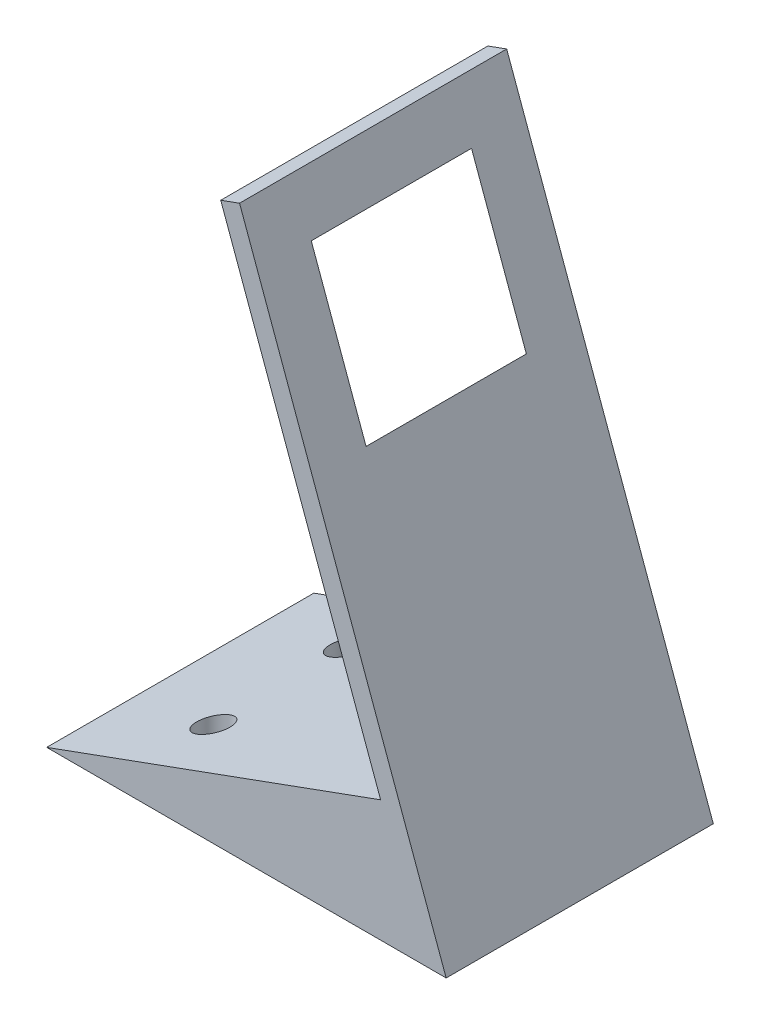
ISO-10303-21;
HEADER;
FILE_DESCRIPTION(('STEP AP214'),'2;1');
FILE_NAME('part.step','',(''),(''),'','','');
FILE_SCHEMA(('AUTOMOTIVE_DESIGN { 1 0 10303 214 1 1 1 1 }'));
ENDSEC;
DATA;
#1=APPLICATION_CONTEXT('core data for automotive mechanical design processes');
#2=APPLICATION_PROTOCOL_DEFINITION('international standard','automotive_design',2000,#1);
#3=PRODUCT_CONTEXT('',#1,'mechanical');
#4=PRODUCT('Part','Part','',(#3));
#5=PRODUCT_RELATED_PRODUCT_CATEGORY('part','',(#4));
#6=PRODUCT_DEFINITION_FORMATION('','',#4);
#7=PRODUCT_DEFINITION_CONTEXT('part definition',#1,'design');
#8=PRODUCT_DEFINITION('design','',#6,#7);
#9=PRODUCT_DEFINITION_SHAPE('','',#8);
#10=(LENGTH_UNIT() NAMED_UNIT(*) SI_UNIT(.MILLI.,.METRE.));
#11=(NAMED_UNIT(*) PLANE_ANGLE_UNIT() SI_UNIT($,.RADIAN.));
#12=(NAMED_UNIT(*) SI_UNIT($,.STERADIAN.) SOLID_ANGLE_UNIT());
#13=UNCERTAINTY_MEASURE_WITH_UNIT(LENGTH_MEASURE(1.E-05),#10,'distance_accuracy_value','');
#14=(GEOMETRIC_REPRESENTATION_CONTEXT(3) GLOBAL_UNCERTAINTY_ASSIGNED_CONTEXT((#13)) GLOBAL_UNIT_ASSIGNED_CONTEXT((#10,
#11,#12)) REPRESENTATION_CONTEXT('',''));
#15=CARTESIAN_POINT('',(0.,0.,0.));
#16=DIRECTION('',(0.,0.,1.));
#17=DIRECTION('',(1.,0.,0.));
#18=AXIS2_PLACEMENT_3D('',#15,#16,#17);
#19=CARTESIAN_POINT('',(52.8190778623577,19.2245721432868,40.));
#20=DIRECTION('',(0.93969262078591,0.342020143325663,0.));
#21=DIRECTION('',(-0.342020143325663,0.939692620785911,0.));
#22=AXIS2_PLACEMENT_3D('',#19,#20,#21);
#23=PLANE('',#22);
#24=DIRECTION('',(0.342020143325663,-0.939692620785911,0.));
#25=VECTOR('',#24,1.);
#26=CARTESIAN_POINT('',(52.8190778623577,19.2245721432868,0.));
#27=LINE('',#26,#25);
#28=CARTESIAN_POINT('',(28.8776678295613,85.0030555983005,0.));
#29=VERTEX_POINT('',#28);
#30=CARTESIAN_POINT('',(59.8162498890172,0.,0.));
#31=VERTEX_POINT('',#30);
#32=EDGE_CURVE('E310',#29,#31,#27,.T.);
#33=ORIENTED_EDGE('',*,*,#32,.F.);
#34=DIRECTION('',(0.,0.,-1.));
#35=VECTOR('',#34,1.);
#36=CARTESIAN_POINT('',(28.8776678295613,85.0030555983005,40.));
#37=LINE('',#36,#35);
#38=CARTESIAN_POINT('',(28.8776678295613,85.0030555983005,40.));
#39=VERTEX_POINT('',#38);
#40=EDGE_CURVE('E53',#39,#29,#37,.T.);
#41=ORIENTED_EDGE('',*,*,#40,.F.);
#42=DIRECTION('',(0.342020143325663,-0.939692620785911,0.));
#43=VECTOR('',#42,1.);
#44=CARTESIAN_POINT('',(52.8190778623577,19.2245721432868,40.));
#45=LINE('',#44,#43);
#46=CARTESIAN_POINT('',(59.8162498890172,0.,40.));
#47=VERTEX_POINT('',#46);
#48=EDGE_CURVE('E294',#39,#47,#45,.T.);
#49=ORIENTED_EDGE('',*,*,#48,.T.);
#50=DIRECTION('',(0.,0.,-1.));
#51=VECTOR('',#50,1.);
#52=CARTESIAN_POINT('',(59.8162498890172,0.,40.));
#53=LINE('',#52,#51);
#54=EDGE_CURVE('E12',#47,#31,#53,.T.);
#55=ORIENTED_EDGE('',*,*,#54,.T.);
#56=EDGE_LOOP('',(#33,#41,#49,#55));
#57=FACE_BOUND('',#56,.T.);
#58=DIRECTION('',(0.,0.,-1.));
#59=VECTOR('',#58,1.);
#60=CARTESIAN_POINT('',(39.8223124159825,54.9328917331513,8.));
#61=LINE('',#60,#59);
#62=CARTESIAN_POINT('',(39.8223124159825,54.9328917331513,32.));
#63=VERTEX_POINT('',#62);
#64=CARTESIAN_POINT('',(39.8223124159825,54.9328917331513,8.00000000000001));
#65=VERTEX_POINT('',#64);
#66=EDGE_CURVE('E47',#63,#65,#61,.T.);
#67=ORIENTED_EDGE('',*,*,#66,.F.);
#68=DIRECTION('',(0.342020143325663,-0.93969262078591,0.));
#69=VECTOR('',#68,1.);
#70=CARTESIAN_POINT('',(31.6138289761666,77.4855146320132,32.));
#71=LINE('',#70,#69);
#72=CARTESIAN_POINT('',(31.6138289761666,77.4855146320132,32.));
#73=VERTEX_POINT('',#72);
#74=EDGE_CURVE('E215',#73,#63,#71,.T.);
#75=ORIENTED_EDGE('',*,*,#74,.F.);
#76=DIRECTION('',(0.,0.,1.));
#77=VECTOR('',#76,1.);
#78=CARTESIAN_POINT('',(31.6138289761666,77.4855146320132,8.));
#79=LINE('',#78,#77);
#80=CARTESIAN_POINT('',(31.6138289761666,77.4855146320132,8.));
#81=VERTEX_POINT('',#80);
#82=EDGE_CURVE('E122',#81,#73,#79,.T.);
#83=ORIENTED_EDGE('',*,*,#82,.F.);
#84=DIRECTION('',(-0.342020143325663,0.93969262078591,0.));
#85=VECTOR('',#84,1.);
#86=CARTESIAN_POINT('',(31.6138289761666,77.4855146320132,8.));
#87=LINE('',#86,#85);
#88=EDGE_CURVE('E186',#65,#81,#87,.T.);
#89=ORIENTED_EDGE('',*,*,#88,.F.);
#90=EDGE_LOOP('',(#67,#75,#83,#89));
#91=FACE_BOUND('',#90,.T.);
#92=ADVANCED_FACE('F43',(#57,#91),#23,.T.);
#93=CARTESIAN_POINT('',(50.,18.1985117133098,40.));
#94=DIRECTION('',(-0.93969262078591,-0.342020143325663,0.));
#95=DIRECTION('',(0.342020143325663,-0.939692620785911,0.));
#96=AXIS2_PLACEMENT_3D('',#93,#94,#95);
#97=PLANE('',#96);
#98=DIRECTION('',(-0.342020143325663,0.939692620785911,0.));
#99=VECTOR('',#98,1.);
#100=CARTESIAN_POINT('',(50.,18.1985117133098,0.));
#101=LINE('',#100,#99);
#102=CARTESIAN_POINT('',(50.,18.1985117133098,0.));
#103=VERTEX_POINT('',#102);
#104=CARTESIAN_POINT('',(26.0585899672036,83.9769951683235,0.));
#105=VERTEX_POINT('',#104);
#106=EDGE_CURVE('E316',#103,#105,#101,.T.);
#107=ORIENTED_EDGE('',*,*,#106,.F.);
#108=DIRECTION('',(0.,0.,-1.));
#109=VECTOR('',#108,1.);
#110=CARTESIAN_POINT('',(50.,18.1985117133098,40.));
#111=LINE('',#110,#109);
#112=CARTESIAN_POINT('',(50.,18.1985117133098,40.));
#113=VERTEX_POINT('',#112);
#114=EDGE_CURVE('E322',#113,#103,#111,.T.);
#115=ORIENTED_EDGE('',*,*,#114,.F.);
#116=DIRECTION('',(-0.342020143325663,0.939692620785911,0.));
#117=VECTOR('',#116,1.);
#118=CARTESIAN_POINT('',(50.,18.1985117133098,40.));
#119=LINE('',#118,#117);
#120=CARTESIAN_POINT('',(26.0585899672036,83.9769951683235,40.));
#121=VERTEX_POINT('',#120);
#122=EDGE_CURVE('E301',#113,#121,#119,.T.);
#123=ORIENTED_EDGE('',*,*,#122,.T.);
#124=DIRECTION('',(0.,0.,-1.));
#125=VECTOR('',#124,1.);
#126=CARTESIAN_POINT('',(26.0585899672036,83.9769951683235,40.));
#127=LINE('',#126,#125);
#128=EDGE_CURVE('E324',#121,#105,#127,.T.);
#129=ORIENTED_EDGE('',*,*,#128,.T.);
#130=EDGE_LOOP('',(#107,#115,#123,#129));
#131=FACE_BOUND('',#130,.T.);
#132=DIRECTION('',(0.,0.,-1.));
#133=VECTOR('',#132,1.);
#134=CARTESIAN_POINT('',(27.7686906838319,79.2785320643939,5.));
#135=LINE('',#134,#133);
#136=CARTESIAN_POINT('',(27.7686906838319,79.2785320643939,35.));
#137=VERTEX_POINT('',#136);
#138=CARTESIAN_POINT('',(27.7686906838319,79.2785320643939,5.00000000000002));
#139=VERTEX_POINT('',#138);
#140=EDGE_CURVE('E118',#137,#139,#135,.T.);
#141=ORIENTED_EDGE('',*,*,#140,.F.);
#142=DIRECTION('',(-0.342020143325663,0.93969262078591,0.));
#143=VECTOR('',#142,1.);
#144=CARTESIAN_POINT('',(27.7686906838319,79.2785320643939,35.));
#145=LINE('',#144,#143);
#146=CARTESIAN_POINT('',(38.0292949836018,51.0877534408166,35.));
#147=VERTEX_POINT('',#146);
#148=EDGE_CURVE('E129',#147,#137,#145,.T.);
#149=ORIENTED_EDGE('',*,*,#148,.F.);
#150=DIRECTION('',(0.,0.,1.));
#151=VECTOR('',#150,1.);
#152=CARTESIAN_POINT('',(38.0292949836018,51.0877534408166,5.));
#153=LINE('',#152,#151);
#154=CARTESIAN_POINT('',(38.0292949836018,51.0877534408166,5.));
#155=VERTEX_POINT('',#154);
#156=EDGE_CURVE('E137',#155,#147,#153,.T.);
#157=ORIENTED_EDGE('',*,*,#156,.F.);
#158=DIRECTION('',(0.342020143325663,-0.93969262078591,0.));
#159=VECTOR('',#158,1.);
#160=CARTESIAN_POINT('',(27.7686906838319,79.2785320643939,5.));
#161=LINE('',#160,#159);
#162=EDGE_CURVE('E143',#139,#155,#161,.T.);
#163=ORIENTED_EDGE('',*,*,#162,.F.);
#164=EDGE_LOOP('',(#141,#149,#157,#163));
#165=FACE_BOUND('',#164,.T.);
#166=ADVANCED_FACE('F142',(#131,#165),#97,.T.);
#167=CARTESIAN_POINT('',(0.,0.,40.));
#168=DIRECTION('',(-0.342020143325663,0.93969262078591,0.));
#169=DIRECTION('',(-0.93969262078591,-0.342020143325663,0.));
#170=AXIS2_PLACEMENT_3D('',#167,#168,#169);
#171=PLANE('',#170);
#172=DIRECTION('',(0.939692620785911,0.342020143325663,0.));
#173=VECTOR('',#172,1.);
#174=CARTESIAN_POINT('',(0.,0.,0.));
#175=LINE('',#174,#173);
#176=CARTESIAN_POINT('',(0.,0.,0.));
#177=VERTEX_POINT('',#176);
#178=EDGE_CURVE('E295',#177,#103,#175,.T.);
#179=ORIENTED_EDGE('',*,*,#178,.F.);
#180=DIRECTION('',(0.,0.,-1.));
#181=VECTOR('',#180,1.);
#182=CARTESIAN_POINT('',(0.,0.,40.));
#183=LINE('',#182,#181);
#184=CARTESIAN_POINT('',(0.,0.,40.));
#185=VERTEX_POINT('',#184);
#186=EDGE_CURVE('E307',#185,#177,#183,.T.);
#187=ORIENTED_EDGE('',*,*,#186,.F.);
#188=DIRECTION('',(0.939692620785911,0.342020143325663,0.));
#189=VECTOR('',#188,1.);
#190=CARTESIAN_POINT('',(0.,0.,40.));
#191=LINE('',#190,#189);
#192=EDGE_CURVE('E304',#185,#113,#191,.T.);
#193=ORIENTED_EDGE('',*,*,#192,.T.);
#194=ORIENTED_EDGE('',*,*,#114,.T.);
#195=EDGE_LOOP('',(#179,#187,#193,#194));
#196=FACE_BOUND('',#195,.T.);
#197=CARTESIAN_POINT('',(44.8621874167629,16.3285008637732,30.));
#198=DIRECTION('',(-0.342020143325663,0.93969262078591,0.));
#199=DIRECTION('',(-0.939692620785911,-0.342020143325663,0.));
#200=AXIS2_PLACEMENT_3D('',#197,#198,#199);
#201=ELLIPSE('',#200,2.66044443118978,2.5);
#202=CARTESIAN_POINT('',(42.3621874167629,15.4185752781077,30.));
#203=VERTEX_POINT('',#202);
#204=EDGE_CURVE('E280',#203,#203,#201,.T.);
#205=ORIENTED_EDGE('',*,*,#204,.F.);
#206=EDGE_LOOP('',(#205));
#207=FACE_BOUND('',#206,.T.);
#208=CARTESIAN_POINT('',(14.9540624722543,5.44283362125772,30.));
#209=DIRECTION('',(-0.342020143325663,0.93969262078591,0.));
#210=DIRECTION('',(-0.939692620785911,-0.342020143325663,0.));
#211=AXIS2_PLACEMENT_3D('',#208,#209,#210);
#212=ELLIPSE('',#211,2.66044443118977,2.5);
#213=CARTESIAN_POINT('',(12.4540624722543,4.53290803559223,30.));
#214=VERTEX_POINT('',#213);
#215=EDGE_CURVE('E271',#214,#214,#212,.F.);
#216=ORIENTED_EDGE('',*,*,#215,.T.);
#217=EDGE_LOOP('',(#216));
#218=FACE_BOUND('',#217,.T.);
#219=CARTESIAN_POINT('',(44.8621874167629,16.3285008637732,10.));
#220=DIRECTION('',(-0.342020143325663,0.93969262078591,0.));
#221=DIRECTION('',(-0.939692620785911,-0.342020143325663,0.));
#222=AXIS2_PLACEMENT_3D('',#219,#220,#221);
#223=ELLIPSE('',#222,2.66044443118978,2.5);
#224=CARTESIAN_POINT('',(42.3621874167629,15.4185752781077,10.));
#225=VERTEX_POINT('',#224);
#226=EDGE_CURVE('E256',#225,#225,#223,.F.);
#227=ORIENTED_EDGE('',*,*,#226,.T.);
#228=EDGE_LOOP('',(#227));
#229=FACE_BOUND('',#228,.T.);
#230=CARTESIAN_POINT('',(14.9540624722543,5.44283362125772,10.));
#231=DIRECTION('',(-0.342020143325663,0.93969262078591,0.));
#232=DIRECTION('',(-0.939692620785911,-0.342020143325663,0.));
#233=AXIS2_PLACEMENT_3D('',#230,#231,#232);
#234=ELLIPSE('',#233,2.66044443118977,2.5);
#235=CARTESIAN_POINT('',(12.4540624722543,4.53290803559223,10.));
#236=VERTEX_POINT('',#235);
#237=EDGE_CURVE('E250',#236,#236,#234,.T.);
#238=ORIENTED_EDGE('',*,*,#237,.F.);
#239=EDGE_LOOP('',(#238));
#240=FACE_BOUND('',#239,.T.);
#241=ADVANCED_FACE('F164',(#196,#207,#218,#229,#240),#171,.T.);
#242=CARTESIAN_POINT('',(44.8621874167629,85.0040555983005,10.));
#243=DIRECTION('',(0.,-1.,0.));
#244=DIRECTION('',(1.,0.,0.));
#245=AXIS2_PLACEMENT_3D('',#242,#243,#244);
#246=CYLINDRICAL_SURFACE('',#245,1.5);
#247=CARTESIAN_POINT('',(44.8621874167629,0.,10.));
#248=DIRECTION('',(0.,-1.,0.));
#249=DIRECTION('',(-1.,0.,0.));
#250=AXIS2_PLACEMENT_3D('',#247,#248,#249);
#251=CIRCLE('',#250,1.5);
#252=CARTESIAN_POINT('',(43.3621874167629,0.,10.));
#253=VERTEX_POINT('',#252);
#254=EDGE_CURVE('E253',#253,#253,#251,.T.);
#255=ORIENTED_EDGE('',*,*,#254,.T.);
#256=EDGE_LOOP('',(#255));
#257=FACE_BOUND('',#256,.T.);
#258=CARTESIAN_POINT('',(44.8621874167629,2.,10.));
#259=DIRECTION('',(0.,1.,0.));
#260=DIRECTION('',(-1.,0.,0.));
#261=AXIS2_PLACEMENT_3D('',#258,#259,#260);
#262=CIRCLE('',#261,1.5);
#263=CARTESIAN_POINT('',(43.3621874167629,2.,10.));
#264=VERTEX_POINT('',#263);
#265=EDGE_CURVE('E239',#264,#264,#262,.T.);
#266=ORIENTED_EDGE('',*,*,#265,.T.);
#267=EDGE_LOOP('',(#266));
#268=FACE_BOUND('',#267,.T.);
#269=ADVANCED_FACE('F346',(#257,#268),#246,.F.);
#270=CARTESIAN_POINT('',(0.,0.,40.));
#271=DIRECTION('',(0.,-1.,0.));
#272=DIRECTION('',(1.,0.,0.));
#273=AXIS2_PLACEMENT_3D('',#270,#271,#272);
#274=PLANE('',#273);
#275=CARTESIAN_POINT('',(14.9540624722543,0.,30.));
#276=DIRECTION('',(0.,-1.,0.));
#277=DIRECTION('',(1.,0.,0.));
#278=AXIS2_PLACEMENT_3D('',#275,#276,#277);
#279=CIRCLE('',#278,1.5);
#280=CARTESIAN_POINT('',(16.4540624722543,0.,30.));
#281=VERTEX_POINT('',#280);
#282=EDGE_CURVE('E285',#281,#281,#279,.T.);
#283=ORIENTED_EDGE('',*,*,#282,.F.);
#284=EDGE_LOOP('',(#283));
#285=FACE_BOUND('',#284,.T.);
#286=DIRECTION('',(-1.,0.,0.));
#287=VECTOR('',#286,1.);
#288=CARTESIAN_POINT('',(0.,0.,0.));
#289=LINE('',#288,#287);
#290=EDGE_CURVE('E288',#31,#177,#289,.T.);
#291=ORIENTED_EDGE('',*,*,#290,.F.);
#292=ORIENTED_EDGE('',*,*,#54,.F.);
#293=DIRECTION('',(-1.,0.,0.));
#294=VECTOR('',#293,1.);
#295=CARTESIAN_POINT('',(0.,0.,40.));
#296=LINE('',#295,#294);
#297=EDGE_CURVE('E291',#47,#185,#296,.T.);
#298=ORIENTED_EDGE('',*,*,#297,.T.);
#299=ORIENTED_EDGE('',*,*,#186,.T.);
#300=EDGE_LOOP('',(#291,#292,#298,#299));
#301=FACE_BOUND('',#300,.T.);
#302=CARTESIAN_POINT('',(44.8621874167629,0.,30.));
#303=DIRECTION('',(0.,1.,0.));
#304=DIRECTION('',(-1.,0.,0.));
#305=AXIS2_PLACEMENT_3D('',#302,#303,#304);
#306=CIRCLE('',#305,1.5);
#307=CARTESIAN_POINT('',(43.3621874167629,0.,30.));
#308=VERTEX_POINT('',#307);
#309=EDGE_CURVE('E274',#308,#308,#306,.T.);
#310=ORIENTED_EDGE('',*,*,#309,.T.);
#311=EDGE_LOOP('',(#310));
#312=FACE_BOUND('',#311,.T.);
#313=ORIENTED_EDGE('',*,*,#254,.F.);
#314=EDGE_LOOP('',(#313));
#315=FACE_BOUND('',#314,.T.);
#316=CARTESIAN_POINT('',(14.9540624722543,0.,10.));
#317=DIRECTION('',(0.,1.,0.));
#318=DIRECTION('',(1.,0.,0.));
#319=AXIS2_PLACEMENT_3D('',#316,#317,#318);
#320=CIRCLE('',#319,1.5);
#321=CARTESIAN_POINT('',(16.4540624722543,0.,10.));
#322=VERTEX_POINT('',#321);
#323=EDGE_CURVE('E261',#322,#322,#320,.T.);
#324=ORIENTED_EDGE('',*,*,#323,.T.);
#325=EDGE_LOOP('',(#324));
#326=FACE_BOUND('',#325,.T.);
#327=ADVANCED_FACE('F45',(#285,#301,#312,#315,#326),#274,.T.);
#328=CARTESIAN_POINT('',(44.8621874167629,85.0040555983005,30.));
#329=DIRECTION('',(0.,-1.,0.));
#330=DIRECTION('',(1.,0.,0.));
#331=AXIS2_PLACEMENT_3D('',#328,#329,#330);
#332=CYLINDRICAL_SURFACE('',#331,1.5);
#333=ORIENTED_EDGE('',*,*,#309,.F.);
#334=EDGE_LOOP('',(#333));
#335=FACE_BOUND('',#334,.T.);
#336=CARTESIAN_POINT('',(44.8621874167629,2.,30.));
#337=DIRECTION('',(0.,1.,0.));
#338=DIRECTION('',(-1.,0.,0.));
#339=AXIS2_PLACEMENT_3D('',#336,#337,#338);
#340=CIRCLE('',#339,1.5);
#341=CARTESIAN_POINT('',(43.3621874167629,2.,30.));
#342=VERTEX_POINT('',#341);
#343=EDGE_CURVE('E277',#342,#342,#340,.F.);
#344=ORIENTED_EDGE('',*,*,#343,.F.);
#345=EDGE_LOOP('',(#344));
#346=FACE_BOUND('',#345,.T.);
#347=ADVANCED_FACE('F408',(#335,#346),#332,.F.);
#348=CARTESIAN_POINT('',(-23.9414100327965,65.7784834550136,40.));
#349=DIRECTION('',(-0.342020143325665,0.93969262078591,0.));
#350=DIRECTION('',(-0.93969262078591,-0.342020143325665,0.));
#351=AXIS2_PLACEMENT_3D('',#348,#349,#350);
#352=PLANE('',#351);
#353=DIRECTION('',(0.93969262078591,0.342020143325665,0.));
#354=VECTOR('',#353,1.);
#355=CARTESIAN_POINT('',(-23.9414100327965,65.7784834550136,0.));
#356=LINE('',#355,#354);
#357=EDGE_CURVE('E313',#105,#29,#356,.T.);
#358=ORIENTED_EDGE('',*,*,#357,.F.);
#359=ORIENTED_EDGE('',*,*,#128,.F.);
#360=DIRECTION('',(0.93969262078591,0.342020143325665,0.));
#361=VECTOR('',#360,1.);
#362=CARTESIAN_POINT('',(-23.9414100327965,65.7784834550136,40.));
#363=LINE('',#362,#361);
#364=EDGE_CURVE('E298',#121,#39,#363,.T.);
#365=ORIENTED_EDGE('',*,*,#364,.T.);
#366=ORIENTED_EDGE('',*,*,#40,.T.);
#367=EDGE_LOOP('',(#358,#359,#365,#366));
#368=FACE_BOUND('',#367,.T.);
#369=ADVANCED_FACE('F167',(#368),#352,.T.);
#370=CARTESIAN_POINT('',(0.,0.,40.));
#371=DIRECTION('',(0.,0.,1.));
#372=DIRECTION('',(1.,0.,0.));
#373=AXIS2_PLACEMENT_3D('',#370,#371,#372);
#374=PLANE('',#373);
#375=ORIENTED_EDGE('',*,*,#297,.F.);
#376=ORIENTED_EDGE('',*,*,#48,.F.);
#377=ORIENTED_EDGE('',*,*,#364,.F.);
#378=ORIENTED_EDGE('',*,*,#122,.F.);
#379=ORIENTED_EDGE('',*,*,#192,.F.);
#380=EDGE_LOOP('',(#375,#376,#377,#378,#379));
#381=FACE_BOUND('',#380,.T.);
#382=ADVANCED_FACE('F339',(#381),#374,.T.);
#383=CARTESIAN_POINT('',(0.,0.,0.));
#384=DIRECTION('',(0.,0.,1.));
#385=DIRECTION('',(1.,0.,0.));
#386=AXIS2_PLACEMENT_3D('',#383,#384,#385);
#387=PLANE('',#386);
#388=ORIENTED_EDGE('',*,*,#290,.T.);
#389=ORIENTED_EDGE('',*,*,#178,.T.);
#390=ORIENTED_EDGE('',*,*,#106,.T.);
#391=ORIENTED_EDGE('',*,*,#357,.T.);
#392=ORIENTED_EDGE('',*,*,#32,.T.);
#393=EDGE_LOOP('',(#388,#389,#390,#391,#392));
#394=FACE_BOUND('',#393,.T.);
#395=ADVANCED_FACE('F333',(#394),#387,.F.);
#396=CARTESIAN_POINT('',(14.9540624722543,85.0040555983005,30.));
#397=DIRECTION('',(0.,-1.,0.));
#398=DIRECTION('',(1.,0.,0.));
#399=AXIS2_PLACEMENT_3D('',#396,#397,#398);
#400=CYLINDRICAL_SURFACE('',#399,1.5);
#401=CARTESIAN_POINT('',(14.9540624722543,2.,30.));
#402=DIRECTION('',(0.,-1.,0.));
#403=DIRECTION('',(1.,0.,0.));
#404=AXIS2_PLACEMENT_3D('',#401,#402,#403);
#405=CIRCLE('',#404,1.5);
#406=CARTESIAN_POINT('',(16.4540624722543,2.,30.));
#407=VERTEX_POINT('',#406);
#408=EDGE_CURVE('E267',#407,#407,#405,.T.);
#409=ORIENTED_EDGE('',*,*,#408,.F.);
#410=EDGE_LOOP('',(#409));
#411=FACE_BOUND('',#410,.T.);
#412=ORIENTED_EDGE('',*,*,#282,.T.);
#413=EDGE_LOOP('',(#412));
#414=FACE_BOUND('',#413,.T.);
#415=ADVANCED_FACE('F397',(#411,#414),#400,.F.);
#416=CARTESIAN_POINT('',(14.9540624722543,85.0040555983005,30.));
#417=DIRECTION('',(0.,-1.,0.));
#418=DIRECTION('',(1.,0.,0.));
#419=AXIS2_PLACEMENT_3D('',#416,#417,#418);
#420=CYLINDRICAL_SURFACE('',#419,2.5);
#421=ORIENTED_EDGE('',*,*,#215,.F.);
#422=EDGE_LOOP('',(#421));
#423=FACE_BOUND('',#422,.T.);
#424=CARTESIAN_POINT('',(14.9540624722543,2.,30.));
#425=DIRECTION('',(0.,-1.,0.));
#426=DIRECTION('',(1.,0.,0.));
#427=AXIS2_PLACEMENT_3D('',#424,#425,#426);
#428=CIRCLE('',#427,2.5);
#429=CARTESIAN_POINT('',(17.4540624722543,2.,30.));
#430=VERTEX_POINT('',#429);
#431=EDGE_CURVE('E270',#430,#430,#428,.T.);
#432=ORIENTED_EDGE('',*,*,#431,.T.);
#433=EDGE_LOOP('',(#432));
#434=FACE_BOUND('',#433,.T.);
#435=ADVANCED_FACE('F393',(#423,#434),#420,.F.);
#436=CARTESIAN_POINT('',(0.,2.,0.));
#437=DIRECTION('',(0.,-1.,0.));
#438=DIRECTION('',(1.,0.,0.));
#439=AXIS2_PLACEMENT_3D('',#436,#437,#438);
#440=PLANE('',#439);
#441=ORIENTED_EDGE('',*,*,#408,.T.);
#442=EDGE_LOOP('',(#441));
#443=FACE_BOUND('',#442,.T.);
#444=ORIENTED_EDGE('',*,*,#431,.F.);
#445=EDGE_LOOP('',(#444));
#446=FACE_BOUND('',#445,.T.);
#447=ADVANCED_FACE('F389',(#443,#446),#440,.F.);
#448=CARTESIAN_POINT('',(44.8621874167629,2.,30.));
#449=DIRECTION('',(0.,1.,0.));
#450=DIRECTION('',(-1.,0.,0.));
#451=AXIS2_PLACEMENT_3D('',#448,#449,#450);
#452=PLANE('',#451);
#453=ORIENTED_EDGE('',*,*,#343,.T.);
#454=EDGE_LOOP('',(#453));
#455=FACE_BOUND('',#454,.T.);
#456=CARTESIAN_POINT('',(44.8621874167629,2.,30.));
#457=DIRECTION('',(0.,1.,0.));
#458=DIRECTION('',(-1.,0.,0.));
#459=AXIS2_PLACEMENT_3D('',#456,#457,#458);
#460=CIRCLE('',#459,2.5);
#461=CARTESIAN_POINT('',(42.3621874167629,2.,30.));
#462=VERTEX_POINT('',#461);
#463=EDGE_CURVE('E264',#462,#462,#460,.T.);
#464=ORIENTED_EDGE('',*,*,#463,.T.);
#465=EDGE_LOOP('',(#464));
#466=FACE_BOUND('',#465,.T.);
#467=ADVANCED_FACE('F392',(#455,#466),#452,.T.);
#468=CARTESIAN_POINT('',(44.8621874167629,85.0040555983005,30.));
#469=DIRECTION('',(0.,-1.,0.));
#470=DIRECTION('',(1.,0.,0.));
#471=AXIS2_PLACEMENT_3D('',#468,#469,#470);
#472=CYLINDRICAL_SURFACE('',#471,2.5);
#473=ORIENTED_EDGE('',*,*,#204,.T.);
#474=EDGE_LOOP('',(#473));
#475=FACE_BOUND('',#474,.T.);
#476=ORIENTED_EDGE('',*,*,#463,.F.);
#477=EDGE_LOOP('',(#476));
#478=FACE_BOUND('',#477,.T.);
#479=ADVANCED_FACE('F384',(#475,#478),#472,.F.);
#480=CARTESIAN_POINT('',(14.9540624722543,85.0040555983005,10.));
#481=DIRECTION('',(0.,-1.,0.));
#482=DIRECTION('',(1.,0.,0.));
#483=AXIS2_PLACEMENT_3D('',#480,#481,#482);
#484=CYLINDRICAL_SURFACE('',#483,1.5);
#485=CARTESIAN_POINT('',(14.9540624722543,2.,10.));
#486=DIRECTION('',(0.,1.,0.));
#487=DIRECTION('',(1.,0.,0.));
#488=AXIS2_PLACEMENT_3D('',#485,#486,#487);
#489=CIRCLE('',#488,1.5);
#490=CARTESIAN_POINT('',(16.4540624722543,2.,10.));
#491=VERTEX_POINT('',#490);
#492=EDGE_CURVE('E243',#491,#491,#489,.T.);
#493=ORIENTED_EDGE('',*,*,#492,.T.);
#494=EDGE_LOOP('',(#493));
#495=FACE_BOUND('',#494,.T.);
#496=ORIENTED_EDGE('',*,*,#323,.F.);
#497=EDGE_LOOP('',(#496));
#498=FACE_BOUND('',#497,.T.);
#499=ADVANCED_FACE('F359',(#495,#498),#484,.F.);
#500=CARTESIAN_POINT('',(14.9540624722543,85.0040555983005,10.));
#501=DIRECTION('',(0.,-1.,0.));
#502=DIRECTION('',(1.,0.,0.));
#503=AXIS2_PLACEMENT_3D('',#500,#501,#502);
#504=CYLINDRICAL_SURFACE('',#503,2.5);
#505=ORIENTED_EDGE('',*,*,#237,.T.);
#506=EDGE_LOOP('',(#505));
#507=FACE_BOUND('',#506,.T.);
#508=CARTESIAN_POINT('',(14.9540624722543,2.,10.));
#509=DIRECTION('',(0.,1.,0.));
#510=DIRECTION('',(1.,0.,0.));
#511=AXIS2_PLACEMENT_3D('',#508,#509,#510);
#512=CIRCLE('',#511,2.5);
#513=CARTESIAN_POINT('',(17.4540624722543,2.,10.));
#514=VERTEX_POINT('',#513);
#515=EDGE_CURVE('E246',#514,#514,#512,.T.);
#516=ORIENTED_EDGE('',*,*,#515,.F.);
#517=EDGE_LOOP('',(#516));
#518=FACE_BOUND('',#517,.T.);
#519=ADVANCED_FACE('F355',(#507,#518),#504,.F.);
#520=CARTESIAN_POINT('',(0.,2.,40.));
#521=DIRECTION('',(0.,-1.,0.));
#522=DIRECTION('',(1.,0.,0.));
#523=AXIS2_PLACEMENT_3D('',#520,#521,#522);
#524=PLANE('',#523);
#525=ORIENTED_EDGE('',*,*,#492,.F.);
#526=EDGE_LOOP('',(#525));
#527=FACE_BOUND('',#526,.T.);
#528=ORIENTED_EDGE('',*,*,#515,.T.);
#529=EDGE_LOOP('',(#528));
#530=FACE_BOUND('',#529,.T.);
#531=ADVANCED_FACE('F358',(#527,#530),#524,.F.);
#532=CARTESIAN_POINT('',(44.8621874167629,2.,10.));
#533=DIRECTION('',(0.,1.,0.));
#534=DIRECTION('',(-1.,0.,0.));
#535=AXIS2_PLACEMENT_3D('',#532,#533,#534);
#536=PLANE('',#535);
#537=CARTESIAN_POINT('',(44.8621874167629,2.,10.));
#538=DIRECTION('',(0.,-1.,0.));
#539=DIRECTION('',(-1.,0.,0.));
#540=AXIS2_PLACEMENT_3D('',#537,#538,#539);
#541=CIRCLE('',#540,2.5);
#542=CARTESIAN_POINT('',(42.3621874167629,2.,10.));
#543=VERTEX_POINT('',#542);
#544=EDGE_CURVE('E247',#543,#543,#541,.T.);
#545=ORIENTED_EDGE('',*,*,#544,.F.);
#546=EDGE_LOOP('',(#545));
#547=FACE_BOUND('',#546,.T.);
#548=ORIENTED_EDGE('',*,*,#265,.F.);
#549=EDGE_LOOP('',(#548));
#550=FACE_BOUND('',#549,.T.);
#551=ADVANCED_FACE('F364',(#547,#550),#536,.T.);
#552=CARTESIAN_POINT('',(44.8621874167629,85.0040555983005,10.));
#553=DIRECTION('',(0.,-1.,0.));
#554=DIRECTION('',(1.,0.,0.));
#555=AXIS2_PLACEMENT_3D('',#552,#553,#554);
#556=CYLINDRICAL_SURFACE('',#555,2.5);
#557=ORIENTED_EDGE('',*,*,#226,.F.);
#558=EDGE_LOOP('',(#557));
#559=FACE_BOUND('',#558,.T.);
#560=ORIENTED_EDGE('',*,*,#544,.T.);
#561=EDGE_LOOP('',(#560));
#562=FACE_BOUND('',#561,.T.);
#563=ADVANCED_FACE('F370',(#559,#562),#556,.F.);
#564=CARTESIAN_POINT('',(41.4446208637535,15.0846083648541,44.1044443118978));
#565=DIRECTION('',(-0.664463024388676,-0.241844762647972,-0.707106781186547));
#566=DIRECTION('',(-0.728739444818682,0.,0.684791078771737));
#567=AXIS2_PLACEMENT_3D('',#564,#565,#566);
#568=PLANE('',#567);
#569=DIRECTION('',(0.345066365748905,0.739997209383595,-0.577350269189627));
#570=VECTOR('',#569,1.);
#571=CARTESIAN_POINT('',(38.0292949836018,51.0877534408166,35.));
#572=LINE('',#571,#570);
#573=EDGE_CURVE('E126',#147,#63,#572,.T.);
#574=ORIENTED_EDGE('',*,*,#573,.F.);
#575=ORIENTED_EDGE('',*,*,#148,.T.);
#576=DIRECTION('',(0.739997209383597,-0.345066365748903,-0.577350269189626));
#577=VECTOR('',#576,1.);
#578=CARTESIAN_POINT('',(27.7686906838319,79.2785320643939,35.));
#579=LINE('',#578,#577);
#580=EDGE_CURVE('E114',#137,#73,#579,.T.);
#581=ORIENTED_EDGE('',*,*,#580,.T.);
#582=ORIENTED_EDGE('',*,*,#74,.T.);
#583=EDGE_LOOP('',(#574,#575,#581,#582));
#584=FACE_BOUND('',#583,.T.);
#585=ADVANCED_FACE('F131',(#584),#568,.T.);
#586=CARTESIAN_POINT('',(35.325099660803,75.7549206902811,0.));
#587=DIRECTION('',(-0.422618261740703,-0.906307787036648,0.));
#588=DIRECTION('',(0.906307787036648,-0.422618261740703,0.));
#589=AXIS2_PLACEMENT_3D('',#586,#587,#588);
#590=PLANE('',#589);
#591=ORIENTED_EDGE('',*,*,#580,.F.);
#592=ORIENTED_EDGE('',*,*,#140,.T.);
#593=DIRECTION('',(0.739997209383597,-0.345066365748903,0.577350269189626));
#594=VECTOR('',#593,1.);
#595=CARTESIAN_POINT('',(27.7686906838319,79.2785320643939,5.));
#596=LINE('',#595,#594);
#597=EDGE_CURVE('E66',#139,#81,#596,.T.);
#598=ORIENTED_EDGE('',*,*,#597,.T.);
#599=ORIENTED_EDGE('',*,*,#82,.T.);
#600=EDGE_LOOP('',(#591,#592,#598,#599));
#601=FACE_BOUND('',#600,.T.);
#602=ADVANCED_FACE('F116',(#601),#590,.T.);
#603=CARTESIAN_POINT('',(11.6692824847023,-5.44147578779076,0.));
#604=DIRECTION('',(-0.906307787036647,0.422618261740706,0.));
#605=DIRECTION('',(-0.422618261740706,-0.906307787036647,0.));
#606=AXIS2_PLACEMENT_3D('',#603,#604,#605);
#607=PLANE('',#606);
#608=DIRECTION('',(0.345066365748905,0.739997209383595,0.577350269189626));
#609=VECTOR('',#608,1.);
#610=CARTESIAN_POINT('',(38.0292949836018,51.0877534408166,5.));
#611=LINE('',#610,#609);
#612=EDGE_CURVE('E61',#155,#65,#611,.T.);
#613=ORIENTED_EDGE('',*,*,#612,.F.);
#614=ORIENTED_EDGE('',*,*,#156,.T.);
#615=ORIENTED_EDGE('',*,*,#573,.T.);
#616=ORIENTED_EDGE('',*,*,#66,.T.);
#617=EDGE_LOOP('',(#613,#614,#615,#616));
#618=FACE_BOUND('',#617,.T.);
#619=ADVANCED_FACE('F496',(#618),#607,.T.);
#620=CARTESIAN_POINT('',(22.6507684480352,8.24420549834074,-24.1044443118977));
#621=DIRECTION('',(-0.664463024388676,-0.241844762647972,0.707106781186548));
#622=DIRECTION('',(0.728739444818682,0.,0.684791078771737));
#623=AXIS2_PLACEMENT_3D('',#620,#621,#622);
#624=PLANE('',#623);
#625=ORIENTED_EDGE('',*,*,#597,.F.);
#626=ORIENTED_EDGE('',*,*,#162,.T.);
#627=ORIENTED_EDGE('',*,*,#612,.T.);
#628=ORIENTED_EDGE('',*,*,#88,.T.);
#629=EDGE_LOOP('',(#625,#626,#627,#628));
#630=FACE_BOUND('',#629,.T.);
#631=ADVANCED_FACE('F375',(#630),#624,.T.);
#632=CLOSED_SHELL('',(#92,#166,#241,#269,#327,#347,#369,#382,#395,#415,#435,#447,#467,#479,#499,
#519,#531,#551,#563,#585,#602,#619,#631));
#633=MANIFOLD_SOLID_BREP('B2',#632);
#634=ADVANCED_BREP_SHAPE_REPRESENTATION('',(#18,#633),#14);
#635=SHAPE_DEFINITION_REPRESENTATION(#9,#634);
ENDSEC;
END-ISO-10303-21;
